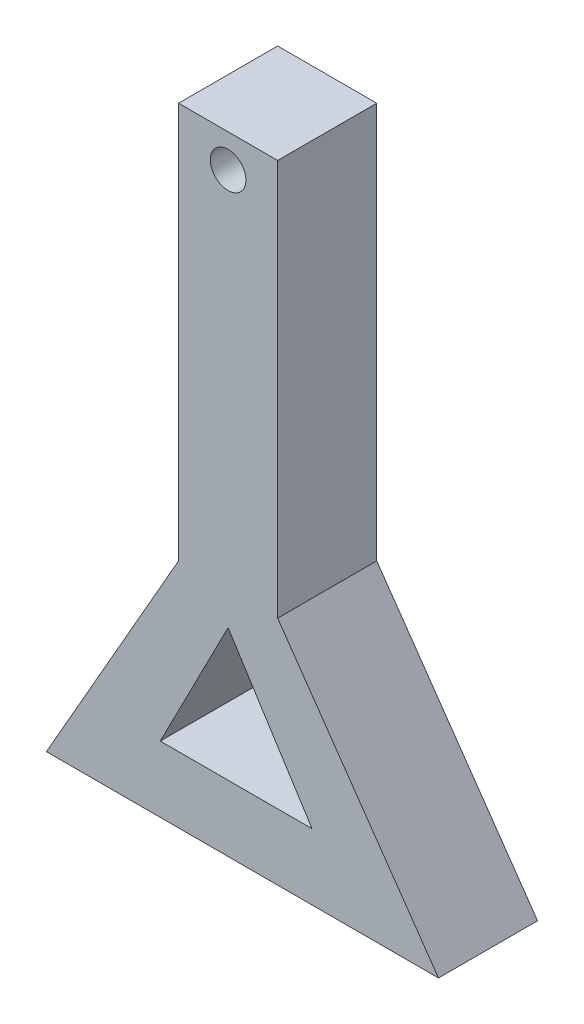
ISO-10303-21;
HEADER;
FILE_DESCRIPTION(('STEP AP214'),'2;1');
FILE_NAME('part.step','',(''),(''),'','','');
FILE_SCHEMA(('AUTOMOTIVE_DESIGN { 1 0 10303 214 1 1 1 1 }'));
ENDSEC;
DATA;
#1=APPLICATION_CONTEXT('core data for automotive mechanical design processes');
#2=APPLICATION_PROTOCOL_DEFINITION('international standard','automotive_design',2000,#1);
#3=PRODUCT_CONTEXT('',#1,'mechanical');
#4=PRODUCT('Part','Part','',(#3));
#5=PRODUCT_RELATED_PRODUCT_CATEGORY('part','',(#4));
#6=PRODUCT_DEFINITION_FORMATION('','',#4);
#7=PRODUCT_DEFINITION_CONTEXT('part definition',#1,'design');
#8=PRODUCT_DEFINITION('design','',#6,#7);
#9=PRODUCT_DEFINITION_SHAPE('','',#8);
#10=(LENGTH_UNIT() NAMED_UNIT(*) SI_UNIT(.MILLI.,.METRE.));
#11=(NAMED_UNIT(*) PLANE_ANGLE_UNIT() SI_UNIT($,.RADIAN.));
#12=(NAMED_UNIT(*) SI_UNIT($,.STERADIAN.) SOLID_ANGLE_UNIT());
#13=UNCERTAINTY_MEASURE_WITH_UNIT(LENGTH_MEASURE(1.E-05),#10,'distance_accuracy_value','');
#14=(GEOMETRIC_REPRESENTATION_CONTEXT(3) GLOBAL_UNCERTAINTY_ASSIGNED_CONTEXT((#13)) GLOBAL_UNIT_ASSIGNED_CONTEXT((#10,
#11,#12)) REPRESENTATION_CONTEXT('',''));
#15=CARTESIAN_POINT('',(0.,0.,0.));
#16=DIRECTION('',(0.,0.,1.));
#17=DIRECTION('',(1.,0.,0.));
#18=AXIS2_PLACEMENT_3D('',#15,#16,#17);
#19=CARTESIAN_POINT('',(0.,0.,10.));
#20=DIRECTION('',(0.,0.,-1.));
#21=DIRECTION('',(-1.,0.,0.));
#22=AXIS2_PLACEMENT_3D('',#19,#20,#21);
#23=PLANE('',#22);
#24=CARTESIAN_POINT('',(0.,55.,10.));
#25=DIRECTION('',(0.,0.,1.));
#26=DIRECTION('',(1.,0.,0.));
#27=AXIS2_PLACEMENT_3D('',#24,#25,#26);
#28=CIRCLE('',#27,2.7);
#29=CARTESIAN_POINT('',(2.7,55.,10.));
#30=VERTEX_POINT('',#29);
#31=EDGE_CURVE('E409',#30,#30,#28,.T.);
#32=ORIENTED_EDGE('',*,*,#31,.F.);
#33=EDGE_LOOP('',(#32));
#34=FACE_BOUND('',#33,.T.);
#35=DIRECTION('',(-0.57100066045059,0.820949600015123,0.));
#36=VECTOR('',#35,1.);
#37=CARTESIAN_POINT('',(7.5,0.,10.));
#38=LINE('',#37,#36);
#39=CARTESIAN_POINT('',(31.8437881148886,-35.,10.));
#40=VERTEX_POINT('',#39);
#41=CARTESIAN_POINT('',(7.5,0.,10.));
#42=VERTEX_POINT('',#41);
#43=EDGE_CURVE('E69',#40,#42,#38,.T.);
#44=ORIENTED_EDGE('',*,*,#43,.T.);
#45=DIRECTION('',(0.,1.,0.));
#46=VECTOR('',#45,1.);
#47=CARTESIAN_POINT('',(7.5,0.,10.));
#48=LINE('',#47,#46);
#49=CARTESIAN_POINT('',(7.5,60.,10.));
#50=VERTEX_POINT('',#49);
#51=EDGE_CURVE('E197',#42,#50,#48,.T.);
#52=ORIENTED_EDGE('',*,*,#51,.T.);
#53=DIRECTION('',(-1.,0.,0.));
#54=VECTOR('',#53,1.);
#55=CARTESIAN_POINT('',(7.5,60.,10.));
#56=LINE('',#55,#54);
#57=CARTESIAN_POINT('',(-7.5,60.,10.));
#58=VERTEX_POINT('',#57);
#59=EDGE_CURVE('E157',#50,#58,#56,.T.);
#60=ORIENTED_EDGE('',*,*,#59,.T.);
#61=DIRECTION('',(0.,-1.,0.));
#62=VECTOR('',#61,1.);
#63=CARTESIAN_POINT('',(-7.5,0.,10.));
#64=LINE('',#63,#62);
#65=CARTESIAN_POINT('',(-7.5,0.,10.));
#66=VERTEX_POINT('',#65);
#67=EDGE_CURVE('E200',#58,#66,#64,.T.);
#68=ORIENTED_EDGE('',*,*,#67,.T.);
#69=DIRECTION('',(-0.496138938356834,-0.868243142124459,0.));
#70=VECTOR('',#69,1.);
#71=CARTESIAN_POINT('',(-7.5,0.,10.));
#72=LINE('',#71,#70);
#73=CARTESIAN_POINT('',(-27.5,-35.,10.));
#74=VERTEX_POINT('',#73);
#75=EDGE_CURVE('E203',#66,#74,#72,.T.);
#76=ORIENTED_EDGE('',*,*,#75,.T.);
#77=DIRECTION('',(1.,0.,0.));
#78=VECTOR('',#77,1.);
#79=CARTESIAN_POINT('',(-27.5,-35.,10.));
#80=LINE('',#79,#78);
#81=EDGE_CURVE('E122',#74,#40,#80,.T.);
#82=ORIENTED_EDGE('',*,*,#81,.T.);
#83=EDGE_LOOP('',(#44,#52,#60,#68,#76,#82));
#84=FACE_BOUND('',#83,.T.);
#85=DIRECTION('',(1.,0.,0.));
#86=VECTOR('',#85,1.);
#87=CARTESIAN_POINT('',(-10.2682032167164,-25.,10.));
#88=LINE('',#87,#86);
#89=CARTESIAN_POINT('',(-10.2682032167164,-25.,10.));
#90=VERTEX_POINT('',#89);
#91=CARTESIAN_POINT('',(12.7074043414919,-25.,10.));
#92=VERTEX_POINT('',#91);
#93=EDGE_CURVE('E177',#90,#92,#88,.T.);
#94=ORIENTED_EDGE('',*,*,#93,.F.);
#95=DIRECTION('',(-0.45673192626276,-0.889604376974568,0.));
#96=VECTOR('',#95,1.);
#97=CARTESIAN_POINT('',(-10.2682032167164,-25.,10.));
#98=LINE('',#97,#96);
#99=CARTESIAN_POINT('',(0.,-5.,10.));
#100=VERTEX_POINT('',#99);
#101=EDGE_CURVE('E186',#100,#90,#98,.T.);
#102=ORIENTED_EDGE('',*,*,#101,.F.);
#103=DIRECTION('',(-0.536278552644205,0.844041061781852,0.));
#104=VECTOR('',#103,1.);
#105=CARTESIAN_POINT('',(0.,-5.,10.));
#106=LINE('',#105,#104);
#107=EDGE_CURVE('E183',#92,#100,#106,.T.);
#108=ORIENTED_EDGE('',*,*,#107,.F.);
#109=EDGE_LOOP('',(#94,#102,#108));
#110=FACE_BOUND('',#109,.T.);
#111=ADVANCED_FACE('F45',(#34,#84,#110),#23,.F.);
#112=CARTESIAN_POINT('',(7.5,0.,10.));
#113=DIRECTION('',(-1.,0.,0.));
#114=DIRECTION('',(0.,-1.,0.));
#115=AXIS2_PLACEMENT_3D('',#112,#113,#114);
#116=PLANE('',#115);
#117=DIRECTION('',(0.,0.,-1.));
#118=VECTOR('',#117,1.);
#119=CARTESIAN_POINT('',(7.5,0.,10.));
#120=LINE('',#119,#118);
#121=CARTESIAN_POINT('',(7.5,0.,-5.00000000000001));
#122=VERTEX_POINT('',#121);
#123=EDGE_CURVE('E210',#42,#122,#120,.T.);
#124=ORIENTED_EDGE('',*,*,#123,.T.);
#125=DIRECTION('',(0.,1.,0.));
#126=VECTOR('',#125,1.);
#127=CARTESIAN_POINT('',(7.5,0.,-5.00000000000001));
#128=LINE('',#127,#126);
#129=CARTESIAN_POINT('',(7.5,60.,-5.00000000000001));
#130=VERTEX_POINT('',#129);
#131=EDGE_CURVE('E158',#122,#130,#128,.T.);
#132=ORIENTED_EDGE('',*,*,#131,.T.);
#133=DIRECTION('',(0.,0.,1.));
#134=VECTOR('',#133,1.);
#135=CARTESIAN_POINT('',(7.5,60.,-5.00000000000001));
#136=LINE('',#135,#134);
#137=EDGE_CURVE('E169',#130,#50,#136,.T.);
#138=ORIENTED_EDGE('',*,*,#137,.T.);
#139=ORIENTED_EDGE('',*,*,#51,.F.);
#140=EDGE_LOOP('',(#124,#132,#138,#139));
#141=FACE_BOUND('',#140,.T.);
#142=ADVANCED_FACE('F47',(#141),#116,.F.);
#143=CARTESIAN_POINT('',(-7.5,0.,10.));
#144=DIRECTION('',(1.,0.,0.));
#145=DIRECTION('',(0.,1.,0.));
#146=AXIS2_PLACEMENT_3D('',#143,#144,#145);
#147=PLANE('',#146);
#148=DIRECTION('',(0.,-1.,0.));
#149=VECTOR('',#148,1.);
#150=CARTESIAN_POINT('',(-7.5,0.,-5.00000000000001));
#151=LINE('',#150,#149);
#152=CARTESIAN_POINT('',(-7.5,60.,-5.00000000000001));
#153=VERTEX_POINT('',#152);
#154=CARTESIAN_POINT('',(-7.5,0.,-5.00000000000001));
#155=VERTEX_POINT('',#154);
#156=EDGE_CURVE('E166',#153,#155,#151,.T.);
#157=ORIENTED_EDGE('',*,*,#156,.T.);
#158=DIRECTION('',(0.,0.,-1.));
#159=VECTOR('',#158,1.);
#160=CARTESIAN_POINT('',(-7.5,0.,10.));
#161=LINE('',#160,#159);
#162=EDGE_CURVE('E11',#66,#155,#161,.T.);
#163=ORIENTED_EDGE('',*,*,#162,.F.);
#164=ORIENTED_EDGE('',*,*,#67,.F.);
#165=DIRECTION('',(0.,0.,1.));
#166=VECTOR('',#165,1.);
#167=CARTESIAN_POINT('',(-7.5,60.,-5.00000000000001));
#168=LINE('',#167,#166);
#169=EDGE_CURVE('E173',#153,#58,#168,.T.);
#170=ORIENTED_EDGE('',*,*,#169,.F.);
#171=EDGE_LOOP('',(#157,#163,#164,#170));
#172=FACE_BOUND('',#171,.T.);
#173=ADVANCED_FACE('F224',(#172),#147,.F.);
#174=CARTESIAN_POINT('',(-7.5,0.,10.));
#175=DIRECTION('',(0.868243142124459,-0.496138938356834,0.));
#176=DIRECTION('',(0.496138938356834,0.868243142124459,0.));
#177=AXIS2_PLACEMENT_3D('',#174,#175,#176);
#178=PLANE('',#177);
#179=ORIENTED_EDGE('',*,*,#162,.T.);
#180=DIRECTION('',(0.496138938356834,0.868243142124459,0.));
#181=VECTOR('',#180,1.);
#182=CARTESIAN_POINT('',(-5.65384615384616,3.23076923076923,-5.00000000000001));
#183=LINE('',#182,#181);
#184=CARTESIAN_POINT('',(-27.5,-35.,-5.00000000000001));
#185=VERTEX_POINT('',#184);
#186=EDGE_CURVE('E128',#185,#155,#183,.T.);
#187=ORIENTED_EDGE('',*,*,#186,.F.);
#188=DIRECTION('',(0.,0.,-1.));
#189=VECTOR('',#188,1.);
#190=CARTESIAN_POINT('',(-27.5,-35.,10.));
#191=LINE('',#190,#189);
#192=EDGE_CURVE('E54',#74,#185,#191,.T.);
#193=ORIENTED_EDGE('',*,*,#192,.F.);
#194=ORIENTED_EDGE('',*,*,#75,.F.);
#195=EDGE_LOOP('',(#179,#187,#193,#194));
#196=FACE_BOUND('',#195,.T.);
#197=ADVANCED_FACE('F129',(#196),#178,.F.);
#198=CARTESIAN_POINT('',(11.8437881148886,-35.,10.));
#199=DIRECTION('',(0.,1.,0.));
#200=DIRECTION('',(0.,0.,1.));
#201=AXIS2_PLACEMENT_3D('',#198,#199,#200);
#202=PLANE('',#201);
#203=ORIENTED_EDGE('',*,*,#192,.T.);
#204=DIRECTION('',(1.,0.,0.));
#205=VECTOR('',#204,1.);
#206=CARTESIAN_POINT('',(0.,-35.,-5.00000000000001));
#207=LINE('',#206,#205);
#208=CARTESIAN_POINT('',(31.8437881148886,-35.,-5.00000000000001));
#209=VERTEX_POINT('',#208);
#210=EDGE_CURVE('E121',#185,#209,#207,.T.);
#211=ORIENTED_EDGE('',*,*,#210,.T.);
#212=DIRECTION('',(0.,0.,-1.));
#213=VECTOR('',#212,1.);
#214=CARTESIAN_POINT('',(31.8437881148886,-35.,10.));
#215=LINE('',#214,#213);
#216=EDGE_CURVE('E126',#40,#209,#215,.T.);
#217=ORIENTED_EDGE('',*,*,#216,.F.);
#218=ORIENTED_EDGE('',*,*,#81,.F.);
#219=EDGE_LOOP('',(#203,#211,#217,#218));
#220=FACE_BOUND('',#219,.T.);
#221=ADVANCED_FACE('F118',(#220),#202,.F.);
#222=CARTESIAN_POINT('',(7.5,0.,10.));
#223=DIRECTION('',(-0.820949600015123,-0.57100066045059,0.));
#224=DIRECTION('',(0.57100066045059,-0.820949600015123,0.));
#225=AXIS2_PLACEMENT_3D('',#222,#223,#224);
#226=PLANE('',#225);
#227=ORIENTED_EDGE('',*,*,#216,.T.);
#228=DIRECTION('',(0.57100066045059,-0.820949600015123,0.));
#229=VECTOR('',#228,1.);
#230=CARTESIAN_POINT('',(5.05468684323742,3.51572072853962,-5.00000000000001));
#231=LINE('',#230,#229);
#232=EDGE_CURVE('E135',#122,#209,#231,.T.);
#233=ORIENTED_EDGE('',*,*,#232,.F.);
#234=ORIENTED_EDGE('',*,*,#123,.F.);
#235=ORIENTED_EDGE('',*,*,#43,.F.);
#236=EDGE_LOOP('',(#227,#233,#234,#235));
#237=FACE_BOUND('',#236,.T.);
#238=ADVANCED_FACE('F215',(#237),#226,.F.);
#239=CARTESIAN_POINT('',(-10.2682032167164,-25.,10.));
#240=DIRECTION('',(0.,1.,0.));
#241=DIRECTION('',(-1.,0.,0.));
#242=AXIS2_PLACEMENT_3D('',#239,#240,#241);
#243=PLANE('',#242);
#244=DIRECTION('',(0.,0.,-1.));
#245=VECTOR('',#244,1.);
#246=CARTESIAN_POINT('',(12.7074043414919,-25.,10.));
#247=LINE('',#246,#245);
#248=CARTESIAN_POINT('',(12.7074043414919,-25.,-5.00000000000001));
#249=VERTEX_POINT('',#248);
#250=EDGE_CURVE('E194',#92,#249,#247,.T.);
#251=ORIENTED_EDGE('',*,*,#250,.T.);
#252=DIRECTION('',(-1.,0.,0.));
#253=VECTOR('',#252,1.);
#254=CARTESIAN_POINT('',(0.,-25.,-5.00000000000001));
#255=LINE('',#254,#253);
#256=CARTESIAN_POINT('',(-10.2682032167164,-25.,-5.00000000000001));
#257=VERTEX_POINT('',#256);
#258=EDGE_CURVE('E147',#249,#257,#255,.T.);
#259=ORIENTED_EDGE('',*,*,#258,.T.);
#260=DIRECTION('',(0.,0.,-1.));
#261=VECTOR('',#260,1.);
#262=CARTESIAN_POINT('',(-10.2682032167164,-25.,10.));
#263=LINE('',#262,#261);
#264=EDGE_CURVE('E189',#90,#257,#263,.T.);
#265=ORIENTED_EDGE('',*,*,#264,.F.);
#266=ORIENTED_EDGE('',*,*,#93,.T.);
#267=EDGE_LOOP('',(#251,#259,#265,#266));
#268=FACE_BOUND('',#267,.T.);
#269=ADVANCED_FACE('F239',(#268),#243,.T.);
#270=CARTESIAN_POINT('',(0.,-5.,10.));
#271=DIRECTION('',(-0.844041061781852,-0.536278552644205,0.));
#272=DIRECTION('',(0.536278552644205,-0.844041061781852,0.));
#273=AXIS2_PLACEMENT_3D('',#270,#271,#272);
#274=PLANE('',#273);
#275=DIRECTION('',(0.,0.,-1.));
#276=VECTOR('',#275,1.);
#277=CARTESIAN_POINT('',(0.,-5.,10.));
#278=LINE('',#277,#276);
#279=CARTESIAN_POINT('',(0.,-5.,-5.00000000000001));
#280=VERTEX_POINT('',#279);
#281=EDGE_CURVE('E61',#100,#280,#278,.T.);
#282=ORIENTED_EDGE('',*,*,#281,.T.);
#283=DIRECTION('',(0.536278552644205,-0.844041061781852,0.));
#284=VECTOR('',#283,1.);
#285=CARTESIAN_POINT('',(-2.26320559492325,-1.43797343013082,-5.00000000000001));
#286=LINE('',#285,#284);
#287=EDGE_CURVE('E143',#280,#249,#286,.T.);
#288=ORIENTED_EDGE('',*,*,#287,.T.);
#289=ORIENTED_EDGE('',*,*,#250,.F.);
#290=ORIENTED_EDGE('',*,*,#107,.T.);
#291=EDGE_LOOP('',(#282,#288,#289,#290));
#292=FACE_BOUND('',#291,.T.);
#293=ADVANCED_FACE('F258',(#292),#274,.T.);
#294=CARTESIAN_POINT('',(-10.2682032167164,-25.,10.));
#295=DIRECTION('',(0.889604376974568,-0.45673192626276,0.));
#296=DIRECTION('',(0.45673192626276,0.889604376974568,0.));
#297=AXIS2_PLACEMENT_3D('',#294,#295,#296);
#298=PLANE('',#297);
#299=ORIENTED_EDGE('',*,*,#264,.T.);
#300=DIRECTION('',(0.45673192626276,0.889604376974568,0.));
#301=VECTOR('',#300,1.);
#302=CARTESIAN_POINT('',(2.03155360353689,-1.04302026233846,-5.00000000000001));
#303=LINE('',#302,#301);
#304=EDGE_CURVE('E154',#257,#280,#303,.T.);
#305=ORIENTED_EDGE('',*,*,#304,.T.);
#306=ORIENTED_EDGE('',*,*,#281,.F.);
#307=ORIENTED_EDGE('',*,*,#101,.T.);
#308=EDGE_LOOP('',(#299,#305,#306,#307));
#309=FACE_BOUND('',#308,.T.);
#310=ADVANCED_FACE('F265',(#309),#298,.T.);
#311=CARTESIAN_POINT('',(7.5,60.,-5.00000000000001));
#312=DIRECTION('',(0.,1.,0.));
#313=DIRECTION('',(0.,0.,1.));
#314=AXIS2_PLACEMENT_3D('',#311,#312,#313);
#315=PLANE('',#314);
#316=ORIENTED_EDGE('',*,*,#59,.F.);
#317=ORIENTED_EDGE('',*,*,#137,.F.);
#318=DIRECTION('',(-1.,0.,0.));
#319=VECTOR('',#318,1.);
#320=CARTESIAN_POINT('',(7.5,60.,-5.00000000000001));
#321=LINE('',#320,#319);
#322=EDGE_CURVE('E162',#130,#153,#321,.T.);
#323=ORIENTED_EDGE('',*,*,#322,.T.);
#324=ORIENTED_EDGE('',*,*,#169,.T.);
#325=EDGE_LOOP('',(#316,#317,#323,#324));
#326=FACE_BOUND('',#325,.T.);
#327=ADVANCED_FACE('F221',(#326),#315,.T.);
#328=CARTESIAN_POINT('',(0.,0.,-5.00000000000001));
#329=DIRECTION('',(0.,0.,1.));
#330=DIRECTION('',(1.,0.,0.));
#331=AXIS2_PLACEMENT_3D('',#328,#329,#330);
#332=PLANE('',#331);
#333=CARTESIAN_POINT('',(0.,55.,-5.));
#334=DIRECTION('',(0.,0.,1.));
#335=DIRECTION('',(1.,0.,0.));
#336=AXIS2_PLACEMENT_3D('',#333,#334,#335);
#337=CIRCLE('',#336,2.7);
#338=CARTESIAN_POINT('',(2.7,55.,-5.));
#339=VERTEX_POINT('',#338);
#340=EDGE_CURVE('E407',#339,#339,#337,.T.);
#341=ORIENTED_EDGE('',*,*,#340,.T.);
#342=EDGE_LOOP('',(#341));
#343=FACE_BOUND('',#342,.T.);
#344=ORIENTED_EDGE('',*,*,#131,.F.);
#345=ORIENTED_EDGE('',*,*,#232,.T.);
#346=ORIENTED_EDGE('',*,*,#210,.F.);
#347=ORIENTED_EDGE('',*,*,#186,.T.);
#348=ORIENTED_EDGE('',*,*,#156,.F.);
#349=ORIENTED_EDGE('',*,*,#322,.F.);
#350=EDGE_LOOP('',(#344,#345,#346,#347,#348,#349));
#351=FACE_BOUND('',#350,.T.);
#352=ORIENTED_EDGE('',*,*,#287,.F.);
#353=ORIENTED_EDGE('',*,*,#304,.F.);
#354=ORIENTED_EDGE('',*,*,#258,.F.);
#355=EDGE_LOOP('',(#352,#353,#354));
#356=FACE_BOUND('',#355,.T.);
#357=ADVANCED_FACE('F139',(#343,#351,#356),#332,.F.);
#358=CARTESIAN_POINT('',(0.,55.,-5.));
#359=DIRECTION('',(0.,0.,1.));
#360=DIRECTION('',(1.,0.,0.));
#361=AXIS2_PLACEMENT_3D('',#358,#359,#360);
#362=CYLINDRICAL_SURFACE('',#361,2.7);
#363=ORIENTED_EDGE('',*,*,#340,.F.);
#364=EDGE_LOOP('',(#363));
#365=FACE_BOUND('',#364,.T.);
#366=ORIENTED_EDGE('',*,*,#31,.T.);
#367=EDGE_LOOP('',(#366));
#368=FACE_BOUND('',#367,.T.);
#369=ADVANCED_FACE('F285',(#365,#368),#362,.F.);
#370=CLOSED_SHELL('',(#111,#142,#173,#197,#221,#238,#269,#293,#310,#327,#357,#369));
#371=MANIFOLD_SOLID_BREP('B2',#370);
#372=ADVANCED_BREP_SHAPE_REPRESENTATION('',(#18,#371),#14);
#373=SHAPE_DEFINITION_REPRESENTATION(#9,#372);
ENDSEC;
END-ISO-10303-21;
